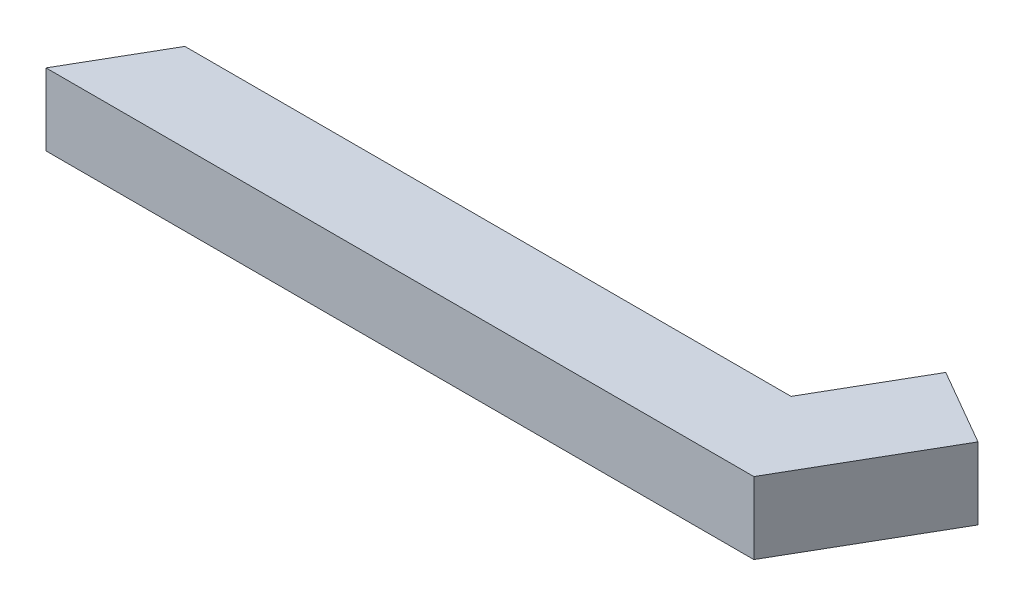
ISO-10303-21;
HEADER;
FILE_DESCRIPTION(('STEP AP214'),'2;1');
FILE_NAME('part.step','',(''),(''),'','','');
FILE_SCHEMA(('AUTOMOTIVE_DESIGN { 1 0 10303 214 1 1 1 1 }'));
ENDSEC;
DATA;
#1=APPLICATION_CONTEXT('core data for automotive mechanical design processes');
#2=APPLICATION_PROTOCOL_DEFINITION('international standard','automotive_design',2000,#1);
#3=PRODUCT_CONTEXT('',#1,'mechanical');
#4=PRODUCT('Part','Part','',(#3));
#5=PRODUCT_RELATED_PRODUCT_CATEGORY('part','',(#4));
#6=PRODUCT_DEFINITION_FORMATION('','',#4);
#7=PRODUCT_DEFINITION_CONTEXT('part definition',#1,'design');
#8=PRODUCT_DEFINITION('design','',#6,#7);
#9=PRODUCT_DEFINITION_SHAPE('','',#8);
#10=(LENGTH_UNIT() NAMED_UNIT(*) SI_UNIT(.MILLI.,.METRE.));
#11=(NAMED_UNIT(*) PLANE_ANGLE_UNIT() SI_UNIT($,.RADIAN.));
#12=(NAMED_UNIT(*) SI_UNIT($,.STERADIAN.) SOLID_ANGLE_UNIT());
#13=UNCERTAINTY_MEASURE_WITH_UNIT(LENGTH_MEASURE(1.E-05),#10,'distance_accuracy_value','');
#14=(GEOMETRIC_REPRESENTATION_CONTEXT(3) GLOBAL_UNCERTAINTY_ASSIGNED_CONTEXT((#13)) GLOBAL_UNIT_ASSIGNED_CONTEXT((#10,
#11,#12)) REPRESENTATION_CONTEXT('',''));
#15=CARTESIAN_POINT('',(0.,0.,0.));
#16=DIRECTION('',(0.,0.,1.));
#17=DIRECTION('',(1.,0.,0.));
#18=AXIS2_PLACEMENT_3D('',#15,#16,#17);
#19=CARTESIAN_POINT('',(0.,25.4,23.3298829890264));
#20=DIRECTION('',(0.,0.,-1.));
#21=DIRECTION('',(-1.,0.,0.));
#22=AXIS2_PLACEMENT_3D('',#19,#20,#21);
#23=PLANE('',#22);
#24=DIRECTION('',(1.,0.,0.));
#25=VECTOR('',#24,1.);
#26=CARTESIAN_POINT('',(0.,0.,23.3298829890264));
#27=LINE('',#26,#25);
#28=CARTESIAN_POINT('',(-123.169565916542,0.,23.3298829890264));
#29=VERTEX_POINT('',#28);
#30=CARTESIAN_POINT('',(126.830434083458,0.,23.3298829890264));
#31=VERTEX_POINT('',#30);
#32=EDGE_CURVE('E117',#29,#31,#27,.T.);
#33=ORIENTED_EDGE('',*,*,#32,.T.);
#34=DIRECTION('',(0.,-1.,0.));
#35=VECTOR('',#34,1.);
#36=CARTESIAN_POINT('',(126.830434083458,25.4,23.3298829890264));
#37=LINE('',#36,#35);
#38=CARTESIAN_POINT('',(126.830434083458,25.4,23.3298829890264));
#39=VERTEX_POINT('',#38);
#40=EDGE_CURVE('E11',#39,#31,#37,.T.);
#41=ORIENTED_EDGE('',*,*,#40,.F.);
#42=DIRECTION('',(1.,0.,0.));
#43=VECTOR('',#42,1.);
#44=CARTESIAN_POINT('',(0.,25.4,23.3298829890264));
#45=LINE('',#44,#43);
#46=CARTESIAN_POINT('',(-123.169565916542,25.4,23.3298829890264));
#47=VERTEX_POINT('',#46);
#48=EDGE_CURVE('E82',#47,#39,#45,.T.);
#49=ORIENTED_EDGE('',*,*,#48,.F.);
#50=DIRECTION('',(0.,-1.,0.));
#51=VECTOR('',#50,1.);
#52=CARTESIAN_POINT('',(-123.169565916542,25.4,23.3298829890264));
#53=LINE('',#52,#51);
#54=EDGE_CURVE('E51',#47,#29,#53,.T.);
#55=ORIENTED_EDGE('',*,*,#54,.T.);
#56=EDGE_LOOP('',(#33,#41,#49,#55));
#57=FACE_BOUND('',#56,.T.);
#58=ADVANCED_FACE('F35',(#57),#23,.F.);
#59=CARTESIAN_POINT('',(105.224961230501,25.4,60.7516596918975));
#60=DIRECTION('',(0.86602540378444,0.,0.499999999999998));
#61=DIRECTION('',(0.499999999999998,0.,-0.86602540378444));
#62=AXIS2_PLACEMENT_3D('',#59,#60,#61);
#63=PLANE('',#62);
#64=DIRECTION('',(-0.499999999999998,0.,0.86602540378444));
#65=VECTOR('',#64,1.);
#66=CARTESIAN_POINT('',(105.224961230501,0.,60.7516596918975));
#67=LINE('',#66,#65);
#68=CARTESIAN_POINT('',(155.808230769356,0.,-26.8611331623511));
#69=VERTEX_POINT('',#68);
#70=EDGE_CURVE('E119',#69,#31,#67,.T.);
#71=ORIENTED_EDGE('',*,*,#70,.F.);
#72=DIRECTION('',(0.,-1.,0.));
#73=VECTOR('',#72,1.);
#74=CARTESIAN_POINT('',(155.808230769356,25.4,-26.8611331623511));
#75=LINE('',#74,#73);
#76=CARTESIAN_POINT('',(155.808230769356,25.4,-26.8611331623511));
#77=VERTEX_POINT('',#76);
#78=EDGE_CURVE('E43',#77,#69,#75,.T.);
#79=ORIENTED_EDGE('',*,*,#78,.F.);
#80=DIRECTION('',(-0.499999999999998,0.,0.86602540378444));
#81=VECTOR('',#80,1.);
#82=CARTESIAN_POINT('',(105.224961230501,25.4,60.7516596918975));
#83=LINE('',#82,#81);
#84=EDGE_CURVE('E156',#77,#39,#83,.T.);
#85=ORIENTED_EDGE('',*,*,#84,.T.);
#86=ORIENTED_EDGE('',*,*,#40,.T.);
#87=EDGE_LOOP('',(#71,#79,#85,#86));
#88=FACE_BOUND('',#87,.T.);
#89=ADVANCED_FACE('F139',(#88),#63,.T.);
#90=CARTESIAN_POINT('',(50.5832695388556,25.4,-87.6127928542489));
#91=DIRECTION('',(0.500000000000001,0.,-0.866025403784438));
#92=DIRECTION('',(-0.866025403784438,0.,-0.500000000000001));
#93=AXIS2_PLACEMENT_3D('',#90,#91,#92);
#94=PLANE('',#93);
#95=DIRECTION('',(0.866025403784438,0.,0.500000000000001));
#96=VECTOR('',#95,1.);
#97=CARTESIAN_POINT('',(50.5832695388556,0.,-87.6127928542489));
#98=LINE('',#97,#96);
#99=CARTESIAN_POINT('',(128.87484071166,0.,-42.4111331623512));
#100=VERTEX_POINT('',#99);
#101=EDGE_CURVE('E122',#100,#69,#98,.T.);
#102=ORIENTED_EDGE('',*,*,#101,.F.);
#103=DIRECTION('',(0.,-1.,0.));
#104=VECTOR('',#103,1.);
#105=CARTESIAN_POINT('',(128.87484071166,25.4,-42.4111331623512));
#106=LINE('',#105,#104);
#107=CARTESIAN_POINT('',(128.87484071166,25.4,-42.4111331623512));
#108=VERTEX_POINT('',#107);
#109=EDGE_CURVE('E102',#108,#100,#106,.T.);
#110=ORIENTED_EDGE('',*,*,#109,.F.);
#111=DIRECTION('',(0.866025403784438,0.,0.500000000000001));
#112=VECTOR('',#111,1.);
#113=CARTESIAN_POINT('',(50.5832695388556,25.4,-87.6127928542489));
#114=LINE('',#113,#112);
#115=EDGE_CURVE('E109',#108,#77,#114,.T.);
#116=ORIENTED_EDGE('',*,*,#115,.T.);
#117=ORIENTED_EDGE('',*,*,#78,.T.);
#118=EDGE_LOOP('',(#102,#110,#116,#117));
#119=FACE_BOUND('',#118,.T.);
#120=ADVANCED_FACE('F136',(#119),#94,.T.);
#121=CARTESIAN_POINT('',(78.2915711728051,25.4,45.2016596918976));
#122=DIRECTION('',(-0.86602540378444,0.,-0.499999999999998));
#123=DIRECTION('',(-0.499999999999998,0.,0.86602540378444));
#124=AXIS2_PLACEMENT_3D('',#121,#122,#123);
#125=PLANE('',#124);
#126=DIRECTION('',(0.499999999999998,0.,-0.86602540378444));
#127=VECTOR('',#126,1.);
#128=CARTESIAN_POINT('',(78.2915711728051,0.,45.2016596918976));
#129=LINE('',#128,#127);
#130=CARTESIAN_POINT('',(108.87484071166,0.,-7.77011701097364));
#131=VERTEX_POINT('',#130);
#132=EDGE_CURVE('E98',#131,#100,#129,.T.);
#133=ORIENTED_EDGE('',*,*,#132,.F.);
#134=DIRECTION('',(0.,-1.,0.));
#135=VECTOR('',#134,1.);
#136=CARTESIAN_POINT('',(108.87484071166,25.4,-7.77011701097364));
#137=LINE('',#136,#135);
#138=CARTESIAN_POINT('',(108.87484071166,25.4,-7.77011701097364));
#139=VERTEX_POINT('',#138);
#140=EDGE_CURVE('E93',#139,#131,#137,.T.);
#141=ORIENTED_EDGE('',*,*,#140,.F.);
#142=DIRECTION('',(0.499999999999998,0.,-0.86602540378444));
#143=VECTOR('',#142,1.);
#144=CARTESIAN_POINT('',(78.2915711728051,25.4,45.2016596918976));
#145=LINE('',#144,#143);
#146=EDGE_CURVE('E96',#139,#108,#145,.T.);
#147=ORIENTED_EDGE('',*,*,#146,.T.);
#148=ORIENTED_EDGE('',*,*,#109,.T.);
#149=EDGE_LOOP('',(#133,#141,#147,#148));
#150=FACE_BOUND('',#149,.T.);
#151=ADVANCED_FACE('F95',(#150),#125,.T.);
#152=CARTESIAN_POINT('',(0.,25.4,-7.77011701097364));
#153=DIRECTION('',(0.,0.,-1.));
#154=DIRECTION('',(-1.,0.,0.));
#155=AXIS2_PLACEMENT_3D('',#152,#153,#154);
#156=PLANE('',#155);
#157=DIRECTION('',(1.,0.,0.));
#158=VECTOR('',#157,1.);
#159=CARTESIAN_POINT('',(0.,0.,-7.77011701097364));
#160=LINE('',#159,#158);
#161=CARTESIAN_POINT('',(-105.213972544745,0.,-7.77011701097363));
#162=VERTEX_POINT('',#161);
#163=EDGE_CURVE('E126',#162,#131,#160,.T.);
#164=ORIENTED_EDGE('',*,*,#163,.F.);
#165=DIRECTION('',(0.,-1.,0.));
#166=VECTOR('',#165,1.);
#167=CARTESIAN_POINT('',(-105.213972544745,25.4,-7.77011701097363));
#168=LINE('',#167,#166);
#169=CARTESIAN_POINT('',(-105.213972544745,25.4,-7.77011701097363));
#170=VERTEX_POINT('',#169);
#171=EDGE_CURVE('E70',#170,#162,#168,.T.);
#172=ORIENTED_EDGE('',*,*,#171,.F.);
#173=DIRECTION('',(1.,0.,0.));
#174=VECTOR('',#173,1.);
#175=CARTESIAN_POINT('',(0.,25.4,-7.77011701097364));
#176=LINE('',#175,#174);
#177=EDGE_CURVE('E107',#170,#139,#176,.T.);
#178=ORIENTED_EDGE('',*,*,#177,.T.);
#179=ORIENTED_EDGE('',*,*,#140,.T.);
#180=EDGE_LOOP('',(#164,#172,#178,#179));
#181=FACE_BOUND('',#180,.T.);
#182=ADVANCED_FACE('F111',(#181),#156,.T.);
#183=CARTESIAN_POINT('',(-82.2750387694992,25.4,-47.501515781157));
#184=DIRECTION('',(-0.86602540378444,0.,-0.499999999999998));
#185=DIRECTION('',(-0.499999999999998,0.,0.86602540378444));
#186=AXIS2_PLACEMENT_3D('',#183,#184,#185);
#187=PLANE('',#186);
#188=DIRECTION('',(0.499999999999998,0.,-0.86602540378444));
#189=VECTOR('',#188,1.);
#190=CARTESIAN_POINT('',(-82.2750387694992,0.,-47.501515781157));
#191=LINE('',#190,#189);
#192=EDGE_CURVE('E128',#29,#162,#191,.T.);
#193=ORIENTED_EDGE('',*,*,#192,.F.);
#194=ORIENTED_EDGE('',*,*,#54,.F.);
#195=DIRECTION('',(0.499999999999998,0.,-0.86602540378444));
#196=VECTOR('',#195,1.);
#197=CARTESIAN_POINT('',(-82.2750387694992,25.4,-47.501515781157));
#198=LINE('',#197,#196);
#199=EDGE_CURVE('E112',#47,#170,#198,.T.);
#200=ORIENTED_EDGE('',*,*,#199,.T.);
#201=ORIENTED_EDGE('',*,*,#171,.T.);
#202=EDGE_LOOP('',(#193,#194,#200,#201));
#203=FACE_BOUND('',#202,.T.);
#204=ADVANCED_FACE('F142',(#203),#187,.T.);
#205=CARTESIAN_POINT('',(0.,25.4,0.));
#206=DIRECTION('',(0.,1.,0.));
#207=DIRECTION('',(0.,0.,1.));
#208=AXIS2_PLACEMENT_3D('',#205,#206,#207);
#209=PLANE('',#208);
#210=ORIENTED_EDGE('',*,*,#48,.T.);
#211=ORIENTED_EDGE('',*,*,#84,.F.);
#212=ORIENTED_EDGE('',*,*,#115,.F.);
#213=ORIENTED_EDGE('',*,*,#146,.F.);
#214=ORIENTED_EDGE('',*,*,#177,.F.);
#215=ORIENTED_EDGE('',*,*,#199,.F.);
#216=EDGE_LOOP('',(#210,#211,#212,#213,#214,#215));
#217=FACE_BOUND('',#216,.T.);
#218=ADVANCED_FACE('F106',(#217),#209,.T.);
#219=CARTESIAN_POINT('',(0.,0.,0.));
#220=DIRECTION('',(0.,1.,0.));
#221=DIRECTION('',(0.,0.,1.));
#222=AXIS2_PLACEMENT_3D('',#219,#220,#221);
#223=PLANE('',#222);
#224=ORIENTED_EDGE('',*,*,#32,.F.);
#225=ORIENTED_EDGE('',*,*,#192,.T.);
#226=ORIENTED_EDGE('',*,*,#163,.T.);
#227=ORIENTED_EDGE('',*,*,#132,.T.);
#228=ORIENTED_EDGE('',*,*,#101,.T.);
#229=ORIENTED_EDGE('',*,*,#70,.T.);
#230=EDGE_LOOP('',(#224,#225,#226,#227,#228,#229));
#231=FACE_BOUND('',#230,.T.);
#232=ADVANCED_FACE('F141',(#231),#223,.F.);
#233=CLOSED_SHELL('',(#58,#89,#120,#151,#182,#204,#218,#232));
#234=MANIFOLD_SOLID_BREP('B2',#233);
#235=ADVANCED_BREP_SHAPE_REPRESENTATION('',(#18,#234),#14);
#236=SHAPE_DEFINITION_REPRESENTATION(#9,#235);
ENDSEC;
END-ISO-10303-21;
